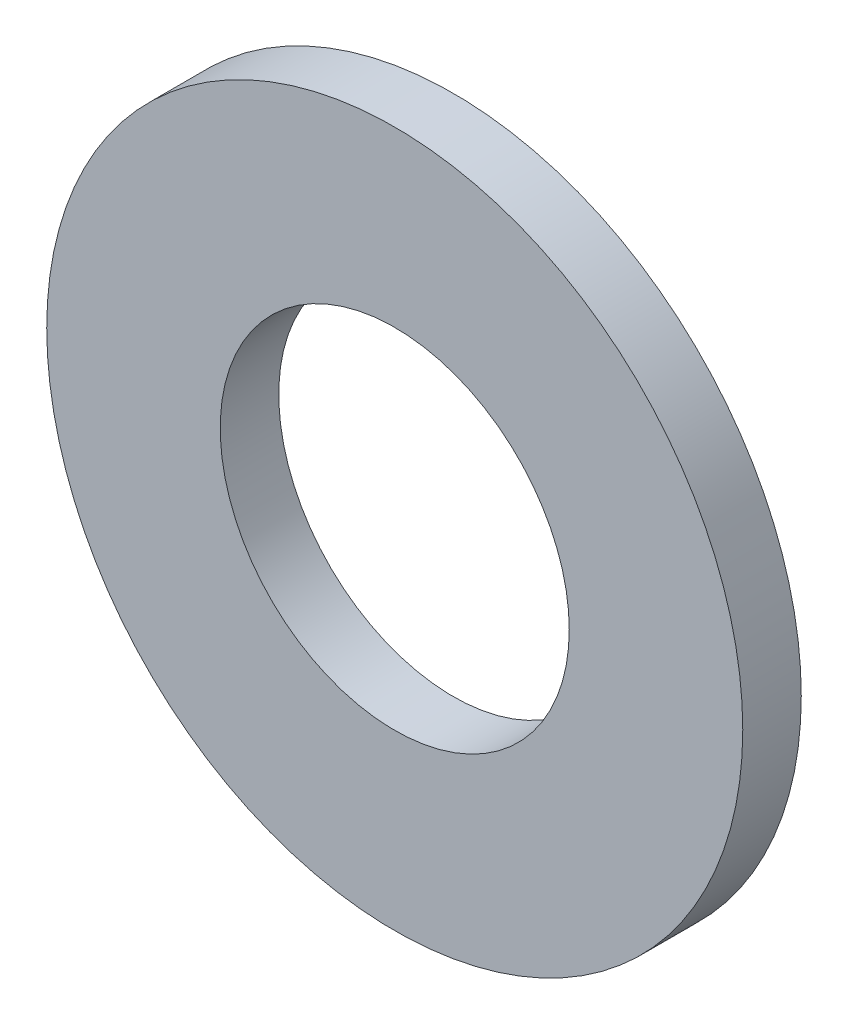
ISO-10303-21;
HEADER;
FILE_DESCRIPTION(('STEP AP214'),'2;1');
FILE_NAME('part.step','',(''),(''),'','','');
FILE_SCHEMA(('AUTOMOTIVE_DESIGN { 1 0 10303 214 1 1 1 1 }'));
ENDSEC;
DATA;
#1=APPLICATION_CONTEXT('core data for automotive mechanical design processes');
#2=APPLICATION_PROTOCOL_DEFINITION('international standard','automotive_design',2000,#1);
#3=PRODUCT_CONTEXT('',#1,'mechanical');
#4=PRODUCT('Part','Part','',(#3));
#5=PRODUCT_RELATED_PRODUCT_CATEGORY('part','',(#4));
#6=PRODUCT_DEFINITION_FORMATION('','',#4);
#7=PRODUCT_DEFINITION_CONTEXT('part definition',#1,'design');
#8=PRODUCT_DEFINITION('design','',#6,#7);
#9=PRODUCT_DEFINITION_SHAPE('','',#8);
#10=(LENGTH_UNIT() NAMED_UNIT(*) SI_UNIT(.MILLI.,.METRE.));
#11=(NAMED_UNIT(*) PLANE_ANGLE_UNIT() SI_UNIT($,.RADIAN.));
#12=(NAMED_UNIT(*) SI_UNIT($,.STERADIAN.) SOLID_ANGLE_UNIT());
#13=UNCERTAINTY_MEASURE_WITH_UNIT(LENGTH_MEASURE(1.E-05),#10,'distance_accuracy_value','');
#14=(GEOMETRIC_REPRESENTATION_CONTEXT(3) GLOBAL_UNCERTAINTY_ASSIGNED_CONTEXT((#13)) GLOBAL_UNIT_ASSIGNED_CONTEXT((#10,
#11,#12)) REPRESENTATION_CONTEXT('',''));
#15=CARTESIAN_POINT('',(0.,0.,0.));
#16=DIRECTION('',(0.,0.,1.));
#17=DIRECTION('',(1.,0.,0.));
#18=AXIS2_PLACEMENT_3D('',#15,#16,#17);
#19=CARTESIAN_POINT('',(0.,0.,1.4732));
#20=DIRECTION('',(0.,0.,-1.));
#21=DIRECTION('',(-1.,0.,0.));
#22=AXIS2_PLACEMENT_3D('',#19,#20,#21);
#23=PLANE('',#22);
#24=CARTESIAN_POINT('',(0.,0.,1.4732));
#25=DIRECTION('',(0.,0.,1.));
#26=DIRECTION('',(1.,0.,0.));
#27=AXIS2_PLACEMENT_3D('',#24,#25,#26);
#28=CIRCLE('',#27,8.763);
#29=CARTESIAN_POINT('',(8.763,0.,1.4732));
#30=VERTEX_POINT('',#29);
#31=EDGE_CURVE('E26',#30,#30,#28,.F.);
#32=ORIENTED_EDGE('',*,*,#31,.F.);
#33=EDGE_LOOP('',(#32));
#34=FACE_BOUND('',#33,.T.);
#35=CARTESIAN_POINT('',(0.,0.,1.4732));
#36=DIRECTION('',(0.,0.,1.));
#37=DIRECTION('',(1.,0.,0.));
#38=AXIS2_PLACEMENT_3D('',#35,#36,#37);
#39=CIRCLE('',#38,4.3942);
#40=CARTESIAN_POINT('',(4.3942,0.,1.4732));
#41=VERTEX_POINT('',#40);
#42=EDGE_CURVE('E17',#41,#41,#39,.F.);
#43=ORIENTED_EDGE('',*,*,#42,.T.);
#44=EDGE_LOOP('',(#43));
#45=FACE_BOUND('',#44,.T.);
#46=ADVANCED_FACE('F14',(#34,#45),#23,.F.);
#47=CARTESIAN_POINT('',(0.,0.,1.4732));
#48=DIRECTION('',(0.,0.,1.));
#49=DIRECTION('',(1.,0.,0.));
#50=AXIS2_PLACEMENT_3D('',#47,#48,#49);
#51=CYLINDRICAL_SURFACE('',#50,4.3942);
#52=CARTESIAN_POINT('',(0.,0.,0.));
#53=DIRECTION('',(0.,0.,1.));
#54=DIRECTION('',(1.,0.,0.));
#55=AXIS2_PLACEMENT_3D('',#52,#53,#54);
#56=CIRCLE('',#55,4.3942);
#57=CARTESIAN_POINT('',(4.3942,0.,0.));
#58=VERTEX_POINT('',#57);
#59=EDGE_CURVE('E21',#58,#58,#56,.T.);
#60=ORIENTED_EDGE('',*,*,#59,.F.);
#61=EDGE_LOOP('',(#60));
#62=FACE_BOUND('',#61,.T.);
#63=ORIENTED_EDGE('',*,*,#42,.F.);
#64=EDGE_LOOP('',(#63));
#65=FACE_BOUND('',#64,.T.);
#66=ADVANCED_FACE('F35',(#62,#65),#51,.F.);
#67=CARTESIAN_POINT('',(0.,0.,1.4732));
#68=DIRECTION('',(0.,0.,1.));
#69=DIRECTION('',(1.,0.,0.));
#70=AXIS2_PLACEMENT_3D('',#67,#68,#69);
#71=CYLINDRICAL_SURFACE('',#70,8.763);
#72=CARTESIAN_POINT('',(0.,0.,0.));
#73=DIRECTION('',(0.,0.,1.));
#74=DIRECTION('',(1.,0.,0.));
#75=AXIS2_PLACEMENT_3D('',#72,#73,#74);
#76=CIRCLE('',#75,8.763);
#77=CARTESIAN_POINT('',(8.763,0.,0.));
#78=VERTEX_POINT('',#77);
#79=EDGE_CURVE('E10',#78,#78,#76,.F.);
#80=ORIENTED_EDGE('',*,*,#79,.F.);
#81=EDGE_LOOP('',(#80));
#82=FACE_BOUND('',#81,.T.);
#83=ORIENTED_EDGE('',*,*,#31,.T.);
#84=EDGE_LOOP('',(#83));
#85=FACE_BOUND('',#84,.T.);
#86=ADVANCED_FACE('F37',(#82,#85),#71,.T.);
#87=CARTESIAN_POINT('',(0.,0.,0.));
#88=DIRECTION('',(0.,0.,-1.));
#89=DIRECTION('',(-1.,0.,0.));
#90=AXIS2_PLACEMENT_3D('',#87,#88,#89);
#91=PLANE('',#90);
#92=ORIENTED_EDGE('',*,*,#79,.T.);
#93=EDGE_LOOP('',(#92));
#94=FACE_BOUND('',#93,.T.);
#95=ORIENTED_EDGE('',*,*,#59,.T.);
#96=EDGE_LOOP('',(#95));
#97=FACE_BOUND('',#96,.T.);
#98=ADVANCED_FACE('F44',(#94,#97),#91,.T.);
#99=CLOSED_SHELL('',(#46,#66,#86,#98));
#100=MANIFOLD_SOLID_BREP('B1',#99);
#101=ADVANCED_BREP_SHAPE_REPRESENTATION('',(#18,#100),#14);
#102=SHAPE_DEFINITION_REPRESENTATION(#9,#101);
ENDSEC;
END-ISO-10303-21;
